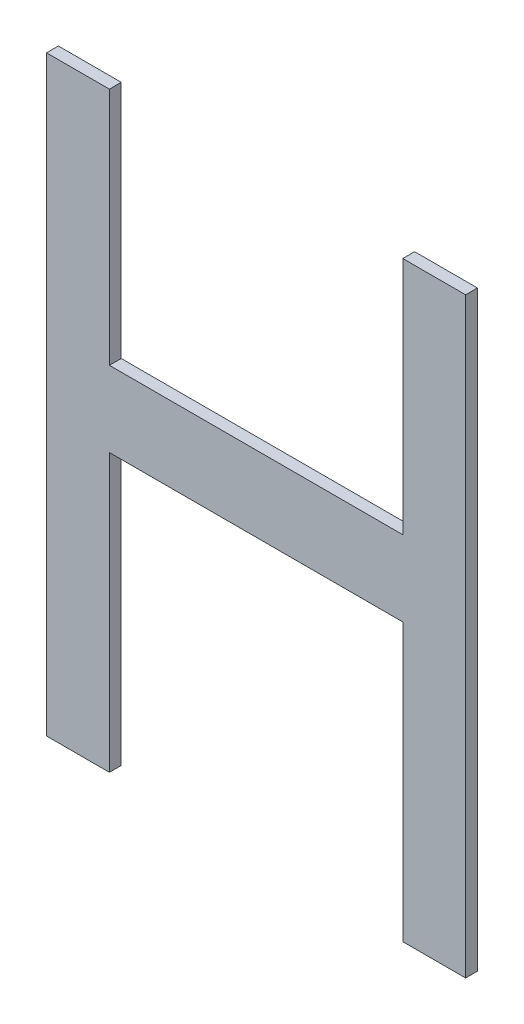
ISO-10303-21;
HEADER;
FILE_DESCRIPTION(('STEP AP214'),'2;1');
FILE_NAME('part.step','',(''),(''),'','','');
FILE_SCHEMA(('AUTOMOTIVE_DESIGN { 1 0 10303 214 1 1 1 1 }'));
ENDSEC;
DATA;
#1=APPLICATION_CONTEXT('core data for automotive mechanical design processes');
#2=APPLICATION_PROTOCOL_DEFINITION('international standard','automotive_design',2000,#1);
#3=PRODUCT_CONTEXT('',#1,'mechanical');
#4=PRODUCT('Part','Part','',(#3));
#5=PRODUCT_RELATED_PRODUCT_CATEGORY('part','',(#4));
#6=PRODUCT_DEFINITION_FORMATION('','',#4);
#7=PRODUCT_DEFINITION_CONTEXT('part definition',#1,'design');
#8=PRODUCT_DEFINITION('design','',#6,#7);
#9=PRODUCT_DEFINITION_SHAPE('','',#8);
#10=(LENGTH_UNIT() NAMED_UNIT(*) SI_UNIT(.MILLI.,.METRE.));
#11=(NAMED_UNIT(*) PLANE_ANGLE_UNIT() SI_UNIT($,.RADIAN.));
#12=(NAMED_UNIT(*) SI_UNIT($,.STERADIAN.) SOLID_ANGLE_UNIT());
#13=UNCERTAINTY_MEASURE_WITH_UNIT(LENGTH_MEASURE(1.E-05),#10,'distance_accuracy_value','');
#14=(GEOMETRIC_REPRESENTATION_CONTEXT(3) GLOBAL_UNCERTAINTY_ASSIGNED_CONTEXT((#13)) GLOBAL_UNIT_ASSIGNED_CONTEXT((#10,
#11,#12)) REPRESENTATION_CONTEXT('',''));
#15=CARTESIAN_POINT('',(0.,0.,0.));
#16=DIRECTION('',(0.,0.,1.));
#17=DIRECTION('',(1.,0.,0.));
#18=AXIS2_PLACEMENT_3D('',#15,#16,#17);
#19=CARTESIAN_POINT('',(175.095164575803,142.200586634191,5.9));
#20=DIRECTION('',(0.,0.,1.));
#21=DIRECTION('',(1.,0.,0.));
#22=AXIS2_PLACEMENT_3D('',#19,#20,#21);
#23=PLANE('',#22);
#24=DIRECTION('',(1.,0.,0.));
#25=VECTOR('',#24,1.);
#26=CARTESIAN_POINT('',(175.095164575803,147.200586634191,5.9));
#27=LINE('',#26,#25);
#28=CARTESIAN_POINT('',(175.626414575803,147.200586634191,5.9));
#29=VERTEX_POINT('',#28);
#30=CARTESIAN_POINT('',(175.095164575803,147.200586634191,5.9));
#31=VERTEX_POINT('',#30);
#32=EDGE_CURVE('E20',#29,#31,#27,.F.);
#33=ORIENTED_EDGE('',*,*,#32,.F.);
#34=DIRECTION('',(0.,1.,0.));
#35=VECTOR('',#34,1.);
#36=CARTESIAN_POINT('',(175.626414575803,145.179309981381,5.9));
#37=LINE('',#36,#35);
#38=CARTESIAN_POINT('',(175.626414575803,145.179309981381,5.9));
#39=VERTEX_POINT('',#38);
#40=EDGE_CURVE('E166',#29,#39,#37,.F.);
#41=ORIENTED_EDGE('',*,*,#40,.T.);
#42=DIRECTION('',(1.,0.,0.));
#43=VECTOR('',#42,1.);
#44=CARTESIAN_POINT('',(178.105581917983,145.179309981381,5.9));
#45=LINE('',#44,#43);
#46=CARTESIAN_POINT('',(178.105581917983,145.179309981381,5.9));
#47=VERTEX_POINT('',#46);
#48=EDGE_CURVE('E161',#39,#47,#45,.T.);
#49=ORIENTED_EDGE('',*,*,#48,.T.);
#50=DIRECTION('',(0.,1.,0.));
#51=VECTOR('',#50,1.);
#52=CARTESIAN_POINT('',(178.105581917983,147.200586634191,5.9));
#53=LINE('',#52,#51);
#54=CARTESIAN_POINT('',(178.105581917983,147.200586634191,5.9));
#55=VERTEX_POINT('',#54);
#56=EDGE_CURVE('E156',#47,#55,#53,.T.);
#57=ORIENTED_EDGE('',*,*,#56,.T.);
#58=DIRECTION('',(1.,0.,0.));
#59=VECTOR('',#58,1.);
#60=CARTESIAN_POINT('',(178.636831917983,147.200586634191,5.9));
#61=LINE('',#60,#59);
#62=CARTESIAN_POINT('',(178.636831917983,147.200586634191,5.9));
#63=VERTEX_POINT('',#62);
#64=EDGE_CURVE('E151',#55,#63,#61,.T.);
#65=ORIENTED_EDGE('',*,*,#64,.T.);
#66=DIRECTION('',(0.,1.,0.));
#67=VECTOR('',#66,1.);
#68=CARTESIAN_POINT('',(178.636831917983,142.200586634191,5.9));
#69=LINE('',#68,#67);
#70=CARTESIAN_POINT('',(178.636831917983,142.200586634191,5.9));
#71=VERTEX_POINT('',#70);
#72=EDGE_CURVE('E146',#63,#71,#69,.F.);
#73=ORIENTED_EDGE('',*,*,#72,.T.);
#74=DIRECTION('',(1.,0.,0.));
#75=VECTOR('',#74,1.);
#76=CARTESIAN_POINT('',(178.105581917983,142.200586634191,5.9));
#77=LINE('',#76,#75);
#78=CARTESIAN_POINT('',(178.105581917983,142.200586634191,5.9));
#79=VERTEX_POINT('',#78);
#80=EDGE_CURVE('E141',#71,#79,#77,.F.);
#81=ORIENTED_EDGE('',*,*,#80,.T.);
#82=DIRECTION('',(0.,1.,0.));
#83=VECTOR('',#82,1.);
#84=CARTESIAN_POINT('',(178.105581917983,144.541012185131,5.9));
#85=LINE('',#84,#83);
#86=CARTESIAN_POINT('',(178.105581917983,144.541012185131,5.9));
#87=VERTEX_POINT('',#86);
#88=EDGE_CURVE('E136',#79,#87,#85,.T.);
#89=ORIENTED_EDGE('',*,*,#88,.T.);
#90=DIRECTION('',(1.,0.,0.));
#91=VECTOR('',#90,1.);
#92=CARTESIAN_POINT('',(175.626414575803,144.541012185131,5.9));
#93=LINE('',#92,#91);
#94=CARTESIAN_POINT('',(175.626414575803,144.541012185131,5.9));
#95=VERTEX_POINT('',#94);
#96=EDGE_CURVE('E132',#87,#95,#93,.F.);
#97=ORIENTED_EDGE('',*,*,#96,.T.);
#98=DIRECTION('',(0.,1.,0.));
#99=VECTOR('',#98,1.);
#100=CARTESIAN_POINT('',(175.626414575803,142.200586634191,5.9));
#101=LINE('',#100,#99);
#102=CARTESIAN_POINT('',(175.626414575803,142.200586634191,5.9));
#103=VERTEX_POINT('',#102);
#104=EDGE_CURVE('E118',#95,#103,#101,.F.);
#105=ORIENTED_EDGE('',*,*,#104,.T.);
#106=DIRECTION('',(1.,0.,0.));
#107=VECTOR('',#106,1.);
#108=CARTESIAN_POINT('',(175.095164575803,142.200586634191,5.9));
#109=LINE('',#108,#107);
#110=CARTESIAN_POINT('',(175.095164575803,142.200586634191,5.9));
#111=VERTEX_POINT('',#110);
#112=EDGE_CURVE('E104',#103,#111,#109,.F.);
#113=ORIENTED_EDGE('',*,*,#112,.T.);
#114=DIRECTION('',(0.,1.,0.));
#115=VECTOR('',#114,1.);
#116=CARTESIAN_POINT('',(175.095164575803,147.200586634191,5.9));
#117=LINE('',#116,#115);
#118=EDGE_CURVE('E110',#111,#31,#117,.T.);
#119=ORIENTED_EDGE('',*,*,#118,.T.);
#120=EDGE_LOOP('',(#33,#41,#49,#57,#65,#73,#81,#89,#97,#105,#113,#119));
#121=FACE_BOUND('',#120,.T.);
#122=ADVANCED_FACE('F17',(#121),#23,.F.);
#123=CARTESIAN_POINT('',(175.095164575803,147.200586634191,6.));
#124=DIRECTION('',(1.,0.,0.));
#125=DIRECTION('',(0.,0.,-1.));
#126=AXIS2_PLACEMENT_3D('',#123,#124,#125);
#127=PLANE('',#126);
#128=DIRECTION('',(0.,0.,1.));
#129=VECTOR('',#128,1.);
#130=CARTESIAN_POINT('',(175.095164575803,142.200586634191,6.));
#131=LINE('',#130,#129);
#132=CARTESIAN_POINT('',(175.095164575803,142.200586634191,6.));
#133=VERTEX_POINT('',#132);
#134=EDGE_CURVE('E112',#111,#133,#131,.T.);
#135=ORIENTED_EDGE('',*,*,#134,.T.);
#136=DIRECTION('',(0.,1.,0.));
#137=VECTOR('',#136,1.);
#138=CARTESIAN_POINT('',(175.095164575803,142.200586634191,6.));
#139=LINE('',#138,#137);
#140=CARTESIAN_POINT('',(175.095164575803,147.200586634191,6.));
#141=VERTEX_POINT('',#140);
#142=EDGE_CURVE('E171',#141,#133,#139,.F.);
#143=ORIENTED_EDGE('',*,*,#142,.F.);
#144=DIRECTION('',(0.,0.,-1.));
#145=VECTOR('',#144,1.);
#146=CARTESIAN_POINT('',(175.095164575803,147.200586634191,6.));
#147=LINE('',#146,#145);
#148=EDGE_CURVE('E115',#141,#31,#147,.T.);
#149=ORIENTED_EDGE('',*,*,#148,.T.);
#150=ORIENTED_EDGE('',*,*,#118,.F.);
#151=EDGE_LOOP('',(#135,#143,#149,#150));
#152=FACE_BOUND('',#151,.T.);
#153=ADVANCED_FACE('F111',(#152),#127,.F.);
#154=CARTESIAN_POINT('',(175.095164575803,142.200586634191,6.));
#155=DIRECTION('',(0.,1.,0.));
#156=DIRECTION('',(0.,0.,1.));
#157=AXIS2_PLACEMENT_3D('',#154,#155,#156);
#158=PLANE('',#157);
#159=DIRECTION('',(0.,0.,1.));
#160=VECTOR('',#159,1.);
#161=CARTESIAN_POINT('',(175.626414575803,142.200586634191,6.));
#162=LINE('',#161,#160);
#163=CARTESIAN_POINT('',(175.626414575803,142.200586634191,6.));
#164=VERTEX_POINT('',#163);
#165=EDGE_CURVE('E120',#103,#164,#162,.T.);
#166=ORIENTED_EDGE('',*,*,#165,.T.);
#167=DIRECTION('',(1.,0.,0.));
#168=VECTOR('',#167,1.);
#169=CARTESIAN_POINT('',(175.095164575803,142.200586634191,6.));
#170=LINE('',#169,#168);
#171=EDGE_CURVE('E124',#133,#164,#170,.T.);
#172=ORIENTED_EDGE('',*,*,#171,.F.);
#173=ORIENTED_EDGE('',*,*,#134,.F.);
#174=ORIENTED_EDGE('',*,*,#112,.F.);
#175=EDGE_LOOP('',(#166,#172,#173,#174));
#176=FACE_BOUND('',#175,.T.);
#177=ADVANCED_FACE('F122',(#176),#158,.F.);
#178=CARTESIAN_POINT('',(175.626414575803,142.200586634191,6.));
#179=DIRECTION('',(-1.,0.,0.));
#180=DIRECTION('',(0.,0.,1.));
#181=AXIS2_PLACEMENT_3D('',#178,#179,#180);
#182=PLANE('',#181);
#183=DIRECTION('',(0.,0.,1.));
#184=VECTOR('',#183,1.);
#185=CARTESIAN_POINT('',(175.626414575803,144.541012185131,6.));
#186=LINE('',#185,#184);
#187=CARTESIAN_POINT('',(175.626414575803,144.541012185131,6.));
#188=VERTEX_POINT('',#187);
#189=EDGE_CURVE('E130',#95,#188,#186,.T.);
#190=ORIENTED_EDGE('',*,*,#189,.T.);
#191=DIRECTION('',(0.,1.,0.));
#192=VECTOR('',#191,1.);
#193=CARTESIAN_POINT('',(175.626414575803,142.200586634191,6.));
#194=LINE('',#193,#192);
#195=EDGE_CURVE('E174',#164,#188,#194,.T.);
#196=ORIENTED_EDGE('',*,*,#195,.F.);
#197=ORIENTED_EDGE('',*,*,#165,.F.);
#198=ORIENTED_EDGE('',*,*,#104,.F.);
#199=EDGE_LOOP('',(#190,#196,#197,#198));
#200=FACE_BOUND('',#199,.T.);
#201=ADVANCED_FACE('F244',(#200),#182,.F.);
#202=CARTESIAN_POINT('',(175.626414575803,144.541012185131,6.));
#203=DIRECTION('',(0.,1.,0.));
#204=DIRECTION('',(0.,0.,1.));
#205=AXIS2_PLACEMENT_3D('',#202,#203,#204);
#206=PLANE('',#205);
#207=DIRECTION('',(0.,0.,-1.));
#208=VECTOR('',#207,1.);
#209=CARTESIAN_POINT('',(178.105581917983,144.541012185131,6.));
#210=LINE('',#209,#208);
#211=CARTESIAN_POINT('',(178.105581917983,144.541012185131,6.));
#212=VERTEX_POINT('',#211);
#213=EDGE_CURVE('E134',#87,#212,#210,.F.);
#214=ORIENTED_EDGE('',*,*,#213,.T.);
#215=DIRECTION('',(1.,0.,0.));
#216=VECTOR('',#215,1.);
#217=CARTESIAN_POINT('',(175.095164575803,144.541012185131,6.));
#218=LINE('',#217,#216);
#219=EDGE_CURVE('E177',#188,#212,#218,.T.);
#220=ORIENTED_EDGE('',*,*,#219,.F.);
#221=ORIENTED_EDGE('',*,*,#189,.F.);
#222=ORIENTED_EDGE('',*,*,#96,.F.);
#223=EDGE_LOOP('',(#214,#220,#221,#222));
#224=FACE_BOUND('',#223,.T.);
#225=ADVANCED_FACE('F240',(#224),#206,.F.);
#226=CARTESIAN_POINT('',(178.105581917983,144.541012185131,6.));
#227=DIRECTION('',(1.,0.,0.));
#228=DIRECTION('',(0.,0.,-1.));
#229=AXIS2_PLACEMENT_3D('',#226,#227,#228);
#230=PLANE('',#229);
#231=DIRECTION('',(0.,0.,1.));
#232=VECTOR('',#231,1.);
#233=CARTESIAN_POINT('',(178.105581917983,142.200586634191,6.));
#234=LINE('',#233,#232);
#235=CARTESIAN_POINT('',(178.105581917983,142.200586634191,6.));
#236=VERTEX_POINT('',#235);
#237=EDGE_CURVE('E139',#79,#236,#234,.T.);
#238=ORIENTED_EDGE('',*,*,#237,.T.);
#239=DIRECTION('',(0.,1.,0.));
#240=VECTOR('',#239,1.);
#241=CARTESIAN_POINT('',(178.105581917983,142.200586634191,6.));
#242=LINE('',#241,#240);
#243=EDGE_CURVE('E180',#212,#236,#242,.F.);
#244=ORIENTED_EDGE('',*,*,#243,.F.);
#245=ORIENTED_EDGE('',*,*,#213,.F.);
#246=ORIENTED_EDGE('',*,*,#88,.F.);
#247=EDGE_LOOP('',(#238,#244,#245,#246));
#248=FACE_BOUND('',#247,.T.);
#249=ADVANCED_FACE('F236',(#248),#230,.F.);
#250=CARTESIAN_POINT('',(178.105581917983,142.200586634191,6.));
#251=DIRECTION('',(0.,1.,0.));
#252=DIRECTION('',(0.,0.,1.));
#253=AXIS2_PLACEMENT_3D('',#250,#251,#252);
#254=PLANE('',#253);
#255=DIRECTION('',(0.,0.,1.));
#256=VECTOR('',#255,1.);
#257=CARTESIAN_POINT('',(178.636831917983,142.200586634191,6.));
#258=LINE('',#257,#256);
#259=CARTESIAN_POINT('',(178.636831917983,142.200586634191,6.));
#260=VERTEX_POINT('',#259);
#261=EDGE_CURVE('E144',#71,#260,#258,.T.);
#262=ORIENTED_EDGE('',*,*,#261,.T.);
#263=DIRECTION('',(1.,0.,0.));
#264=VECTOR('',#263,1.);
#265=CARTESIAN_POINT('',(175.095164575803,142.200586634191,6.));
#266=LINE('',#265,#264);
#267=EDGE_CURVE('E183',#236,#260,#266,.T.);
#268=ORIENTED_EDGE('',*,*,#267,.F.);
#269=ORIENTED_EDGE('',*,*,#237,.F.);
#270=ORIENTED_EDGE('',*,*,#80,.F.);
#271=EDGE_LOOP('',(#262,#268,#269,#270));
#272=FACE_BOUND('',#271,.T.);
#273=ADVANCED_FACE('F232',(#272),#254,.F.);
#274=CARTESIAN_POINT('',(178.636831917983,142.200586634191,6.));
#275=DIRECTION('',(-1.,0.,0.));
#276=DIRECTION('',(0.,0.,1.));
#277=AXIS2_PLACEMENT_3D('',#274,#275,#276);
#278=PLANE('',#277);
#279=DIRECTION('',(0.,0.,-1.));
#280=VECTOR('',#279,1.);
#281=CARTESIAN_POINT('',(178.636831917983,147.200586634191,6.));
#282=LINE('',#281,#280);
#283=CARTESIAN_POINT('',(178.636831917983,147.200586634191,6.));
#284=VERTEX_POINT('',#283);
#285=EDGE_CURVE('E149',#63,#284,#282,.F.);
#286=ORIENTED_EDGE('',*,*,#285,.T.);
#287=DIRECTION('',(0.,1.,0.));
#288=VECTOR('',#287,1.);
#289=CARTESIAN_POINT('',(178.636831917983,142.200586634191,6.));
#290=LINE('',#289,#288);
#291=EDGE_CURVE('E186',#260,#284,#290,.T.);
#292=ORIENTED_EDGE('',*,*,#291,.F.);
#293=ORIENTED_EDGE('',*,*,#261,.F.);
#294=ORIENTED_EDGE('',*,*,#72,.F.);
#295=EDGE_LOOP('',(#286,#292,#293,#294));
#296=FACE_BOUND('',#295,.T.);
#297=ADVANCED_FACE('F228',(#296),#278,.F.);
#298=CARTESIAN_POINT('',(178.636831917983,147.200586634191,6.));
#299=DIRECTION('',(0.,-1.,0.));
#300=DIRECTION('',(0.,0.,-1.));
#301=AXIS2_PLACEMENT_3D('',#298,#299,#300);
#302=PLANE('',#301);
#303=DIRECTION('',(0.,0.,-1.));
#304=VECTOR('',#303,1.);
#305=CARTESIAN_POINT('',(178.105581917983,147.200586634191,6.));
#306=LINE('',#305,#304);
#307=CARTESIAN_POINT('',(178.105581917983,147.200586634191,6.));
#308=VERTEX_POINT('',#307);
#309=EDGE_CURVE('E154',#55,#308,#306,.F.);
#310=ORIENTED_EDGE('',*,*,#309,.T.);
#311=DIRECTION('',(1.,0.,0.));
#312=VECTOR('',#311,1.);
#313=CARTESIAN_POINT('',(175.095164575803,147.200586634191,6.));
#314=LINE('',#313,#312);
#315=EDGE_CURVE('E189',#284,#308,#314,.F.);
#316=ORIENTED_EDGE('',*,*,#315,.F.);
#317=ORIENTED_EDGE('',*,*,#285,.F.);
#318=ORIENTED_EDGE('',*,*,#64,.F.);
#319=EDGE_LOOP('',(#310,#316,#317,#318));
#320=FACE_BOUND('',#319,.T.);
#321=ADVANCED_FACE('F224',(#320),#302,.F.);
#322=CARTESIAN_POINT('',(178.105581917983,147.200586634191,6.));
#323=DIRECTION('',(1.,0.,0.));
#324=DIRECTION('',(0.,0.,-1.));
#325=AXIS2_PLACEMENT_3D('',#322,#323,#324);
#326=PLANE('',#325);
#327=DIRECTION('',(0.,0.,-1.));
#328=VECTOR('',#327,1.);
#329=CARTESIAN_POINT('',(178.105581917983,145.179309981381,6.));
#330=LINE('',#329,#328);
#331=CARTESIAN_POINT('',(178.105581917983,145.179309981381,6.));
#332=VERTEX_POINT('',#331);
#333=EDGE_CURVE('E159',#47,#332,#330,.F.);
#334=ORIENTED_EDGE('',*,*,#333,.T.);
#335=DIRECTION('',(0.,1.,0.));
#336=VECTOR('',#335,1.);
#337=CARTESIAN_POINT('',(178.105581917983,142.200586634191,6.));
#338=LINE('',#337,#336);
#339=EDGE_CURVE('E192',#308,#332,#338,.F.);
#340=ORIENTED_EDGE('',*,*,#339,.F.);
#341=ORIENTED_EDGE('',*,*,#309,.F.);
#342=ORIENTED_EDGE('',*,*,#56,.F.);
#343=EDGE_LOOP('',(#334,#340,#341,#342));
#344=FACE_BOUND('',#343,.T.);
#345=ADVANCED_FACE('F221',(#344),#326,.F.);
#346=CARTESIAN_POINT('',(178.105581917983,145.179309981381,6.));
#347=DIRECTION('',(0.,-1.,0.));
#348=DIRECTION('',(0.,0.,-1.));
#349=AXIS2_PLACEMENT_3D('',#346,#347,#348);
#350=PLANE('',#349);
#351=DIRECTION('',(0.,0.,1.));
#352=VECTOR('',#351,1.);
#353=CARTESIAN_POINT('',(175.626414575803,145.179309981381,6.));
#354=LINE('',#353,#352);
#355=CARTESIAN_POINT('',(175.626414575803,145.179309981381,6.));
#356=VERTEX_POINT('',#355);
#357=EDGE_CURVE('E164',#39,#356,#354,.T.);
#358=ORIENTED_EDGE('',*,*,#357,.T.);
#359=DIRECTION('',(1.,0.,0.));
#360=VECTOR('',#359,1.);
#361=CARTESIAN_POINT('',(175.095164575803,145.179309981381,6.));
#362=LINE('',#361,#360);
#363=EDGE_CURVE('E195',#332,#356,#362,.F.);
#364=ORIENTED_EDGE('',*,*,#363,.F.);
#365=ORIENTED_EDGE('',*,*,#333,.F.);
#366=ORIENTED_EDGE('',*,*,#48,.F.);
#367=EDGE_LOOP('',(#358,#364,#365,#366));
#368=FACE_BOUND('',#367,.T.);
#369=ADVANCED_FACE('F205',(#368),#350,.F.);
#370=CARTESIAN_POINT('',(175.626414575803,145.179309981381,6.));
#371=DIRECTION('',(-1.,0.,0.));
#372=DIRECTION('',(0.,0.,1.));
#373=AXIS2_PLACEMENT_3D('',#370,#371,#372);
#374=PLANE('',#373);
#375=DIRECTION('',(0.,0.,-1.));
#376=VECTOR('',#375,1.);
#377=CARTESIAN_POINT('',(175.626414575803,147.200586634191,6.));
#378=LINE('',#377,#376);
#379=CARTESIAN_POINT('',(175.626414575803,147.200586634191,6.));
#380=VERTEX_POINT('',#379);
#381=EDGE_CURVE('E35',#29,#380,#378,.F.);
#382=ORIENTED_EDGE('',*,*,#381,.T.);
#383=DIRECTION('',(0.,1.,0.));
#384=VECTOR('',#383,1.);
#385=CARTESIAN_POINT('',(175.626414575803,142.200586634191,6.));
#386=LINE('',#385,#384);
#387=EDGE_CURVE('E26',#356,#380,#386,.T.);
#388=ORIENTED_EDGE('',*,*,#387,.F.);
#389=ORIENTED_EDGE('',*,*,#357,.F.);
#390=ORIENTED_EDGE('',*,*,#40,.F.);
#391=EDGE_LOOP('',(#382,#388,#389,#390));
#392=FACE_BOUND('',#391,.T.);
#393=ADVANCED_FACE('F203',(#392),#374,.F.);
#394=CARTESIAN_POINT('',(175.626414575803,147.200586634191,6.));
#395=DIRECTION('',(0.,-1.,0.));
#396=DIRECTION('',(0.,0.,-1.));
#397=AXIS2_PLACEMENT_3D('',#394,#395,#396);
#398=PLANE('',#397);
#399=ORIENTED_EDGE('',*,*,#148,.F.);
#400=DIRECTION('',(1.,0.,0.));
#401=VECTOR('',#400,1.);
#402=CARTESIAN_POINT('',(175.095164575803,147.200586634191,6.));
#403=LINE('',#402,#401);
#404=EDGE_CURVE('E11',#380,#141,#403,.F.);
#405=ORIENTED_EDGE('',*,*,#404,.F.);
#406=ORIENTED_EDGE('',*,*,#381,.F.);
#407=ORIENTED_EDGE('',*,*,#32,.T.);
#408=EDGE_LOOP('',(#399,#405,#406,#407));
#409=FACE_BOUND('',#408,.T.);
#410=ADVANCED_FACE('F208',(#409),#398,.F.);
#411=CARTESIAN_POINT('',(175.095164575803,142.200586634191,6.));
#412=DIRECTION('',(0.,0.,1.));
#413=DIRECTION('',(1.,0.,0.));
#414=AXIS2_PLACEMENT_3D('',#411,#412,#413);
#415=PLANE('',#414);
#416=ORIENTED_EDGE('',*,*,#387,.T.);
#417=ORIENTED_EDGE('',*,*,#404,.T.);
#418=ORIENTED_EDGE('',*,*,#142,.T.);
#419=ORIENTED_EDGE('',*,*,#171,.T.);
#420=ORIENTED_EDGE('',*,*,#195,.T.);
#421=ORIENTED_EDGE('',*,*,#219,.T.);
#422=ORIENTED_EDGE('',*,*,#243,.T.);
#423=ORIENTED_EDGE('',*,*,#267,.T.);
#424=ORIENTED_EDGE('',*,*,#291,.T.);
#425=ORIENTED_EDGE('',*,*,#315,.T.);
#426=ORIENTED_EDGE('',*,*,#339,.T.);
#427=ORIENTED_EDGE('',*,*,#363,.T.);
#428=EDGE_LOOP('',(#416,#417,#418,#419,#420,#421,#422,#423,#424,#425,#426,#427));
#429=FACE_BOUND('',#428,.T.);
#430=ADVANCED_FACE('F200',(#429),#415,.T.);
#431=CLOSED_SHELL('',(#122,#153,#177,#201,#225,#249,#273,#297,#321,#345,#369,#393,#410,#430));
#432=MANIFOLD_SOLID_BREP('B1',#431);
#433=ADVANCED_BREP_SHAPE_REPRESENTATION('',(#18,#432),#14);
#434=SHAPE_DEFINITION_REPRESENTATION(#9,#433);
ENDSEC;
END-ISO-10303-21;
